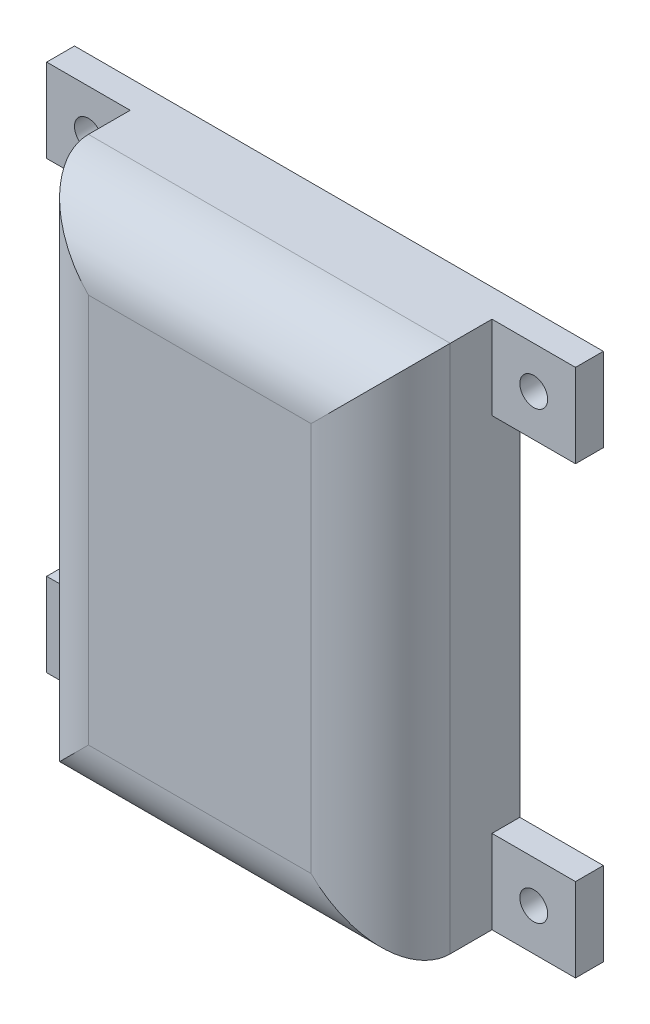
ISO-10303-21;
HEADER;
FILE_DESCRIPTION(('STEP AP214'),'2;1');
FILE_NAME('part.step','',(''),(''),'','','');
FILE_SCHEMA(('AUTOMOTIVE_DESIGN { 1 0 10303 214 1 1 1 1 }'));
ENDSEC;
DATA;
#1=APPLICATION_CONTEXT('core data for automotive mechanical design processes');
#2=APPLICATION_PROTOCOL_DEFINITION('international standard','automotive_design',2000,#1);
#3=PRODUCT_CONTEXT('',#1,'mechanical');
#4=PRODUCT('Part','Part','',(#3));
#5=PRODUCT_RELATED_PRODUCT_CATEGORY('part','',(#4));
#6=PRODUCT_DEFINITION_FORMATION('','',#4);
#7=PRODUCT_DEFINITION_CONTEXT('part definition',#1,'design');
#8=PRODUCT_DEFINITION('design','',#6,#7);
#9=PRODUCT_DEFINITION_SHAPE('','',#8);
#10=(LENGTH_UNIT() NAMED_UNIT(*) SI_UNIT(.MILLI.,.METRE.));
#11=(NAMED_UNIT(*) PLANE_ANGLE_UNIT() SI_UNIT($,.RADIAN.));
#12=(NAMED_UNIT(*) SI_UNIT($,.STERADIAN.) SOLID_ANGLE_UNIT());
#13=UNCERTAINTY_MEASURE_WITH_UNIT(LENGTH_MEASURE(1.E-05),#10,'distance_accuracy_value','');
#14=(GEOMETRIC_REPRESENTATION_CONTEXT(3) GLOBAL_UNCERTAINTY_ASSIGNED_CONTEXT((#13)) GLOBAL_UNIT_ASSIGNED_CONTEXT((#10,
#11,#12)) REPRESENTATION_CONTEXT('',''));
#15=CARTESIAN_POINT('',(0.,0.,0.));
#16=DIRECTION('',(0.,0.,1.));
#17=DIRECTION('',(1.,0.,0.));
#18=AXIS2_PLACEMENT_3D('',#15,#16,#17);
#19=CARTESIAN_POINT('',(-13.,19.,0.));
#20=DIRECTION('',(0.,0.,1.));
#21=DIRECTION('',(1.,0.,0.));
#22=AXIS2_PLACEMENT_3D('',#19,#20,#21);
#23=PLANE('',#22);
#24=CARTESIAN_POINT('',(16.,-16.,0.));
#25=DIRECTION('',(0.,0.,1.));
#26=DIRECTION('',(1.,0.,0.));
#27=AXIS2_PLACEMENT_3D('',#24,#25,#26);
#28=CIRCLE('',#27,1.00000000000001);
#29=CARTESIAN_POINT('',(17.,-16.,0.));
#30=VERTEX_POINT('',#29);
#31=EDGE_CURVE('E752',#30,#30,#28,.T.);
#32=ORIENTED_EDGE('',*,*,#31,.T.);
#33=EDGE_LOOP('',(#32));
#34=FACE_BOUND('',#33,.T.);
#35=CARTESIAN_POINT('',(-16.,16.,0.));
#36=DIRECTION('',(0.,0.,1.));
#37=DIRECTION('',(1.,0.,0.));
#38=AXIS2_PLACEMENT_3D('',#35,#36,#37);
#39=CIRCLE('',#38,1.);
#40=CARTESIAN_POINT('',(-15.,16.,0.));
#41=VERTEX_POINT('',#40);
#42=EDGE_CURVE('E763',#41,#41,#39,.T.);
#43=ORIENTED_EDGE('',*,*,#42,.T.);
#44=EDGE_LOOP('',(#43));
#45=FACE_BOUND('',#44,.T.);
#46=DIRECTION('',(0.,-1.,0.));
#47=VECTOR('',#46,1.);
#48=CARTESIAN_POINT('',(-13.,-19.,0.));
#49=LINE('',#48,#47);
#50=CARTESIAN_POINT('',(-13.,13.,0.));
#51=VERTEX_POINT('',#50);
#52=CARTESIAN_POINT('',(-13.,-13.,0.));
#53=VERTEX_POINT('',#52);
#54=EDGE_CURVE('E246',#51,#53,#49,.T.);
#55=ORIENTED_EDGE('',*,*,#54,.F.);
#56=DIRECTION('',(1.,0.,0.));
#57=VECTOR('',#56,1.);
#58=CARTESIAN_POINT('',(-13.,13.,0.));
#59=LINE('',#58,#57);
#60=CARTESIAN_POINT('',(-19.,13.,0.));
#61=VERTEX_POINT('',#60);
#62=EDGE_CURVE('E213',#61,#51,#59,.T.);
#63=ORIENTED_EDGE('',*,*,#62,.F.);
#64=DIRECTION('',(0.,-1.,0.));
#65=VECTOR('',#64,1.);
#66=CARTESIAN_POINT('',(-19.,19.,0.));
#67=LINE('',#66,#65);
#68=CARTESIAN_POINT('',(-19.,19.,0.));
#69=VERTEX_POINT('',#68);
#70=EDGE_CURVE('E211',#69,#61,#67,.T.);
#71=ORIENTED_EDGE('',*,*,#70,.F.);
#72=DIRECTION('',(-1.,0.,0.));
#73=VECTOR('',#72,1.);
#74=CARTESIAN_POINT('',(13.,19.,0.));
#75=LINE('',#74,#73);
#76=CARTESIAN_POINT('',(19.,19.,0.));
#77=VERTEX_POINT('',#76);
#78=EDGE_CURVE('E196',#77,#69,#75,.T.);
#79=ORIENTED_EDGE('',*,*,#78,.F.);
#80=DIRECTION('',(0.,1.,0.));
#81=VECTOR('',#80,1.);
#82=CARTESIAN_POINT('',(19.,19.,0.));
#83=LINE('',#82,#81);
#84=CARTESIAN_POINT('',(19.,13.,0.));
#85=VERTEX_POINT('',#84);
#86=EDGE_CURVE('E305',#85,#77,#83,.T.);
#87=ORIENTED_EDGE('',*,*,#86,.F.);
#88=DIRECTION('',(1.,0.,0.));
#89=VECTOR('',#88,1.);
#90=CARTESIAN_POINT('',(13.,13.,0.));
#91=LINE('',#90,#89);
#92=CARTESIAN_POINT('',(13.,13.,0.));
#93=VERTEX_POINT('',#92);
#94=EDGE_CURVE('E302',#93,#85,#91,.T.);
#95=ORIENTED_EDGE('',*,*,#94,.F.);
#96=DIRECTION('',(0.,1.,0.));
#97=VECTOR('',#96,1.);
#98=CARTESIAN_POINT('',(13.,-19.,0.));
#99=LINE('',#98,#97);
#100=CARTESIAN_POINT('',(13.,-13.,0.));
#101=VERTEX_POINT('',#100);
#102=EDGE_CURVE('E258',#101,#93,#99,.T.);
#103=ORIENTED_EDGE('',*,*,#102,.F.);
#104=DIRECTION('',(-1.,0.,0.));
#105=VECTOR('',#104,1.);
#106=CARTESIAN_POINT('',(13.,-13.,0.));
#107=LINE('',#106,#105);
#108=CARTESIAN_POINT('',(19.,-13.,0.));
#109=VERTEX_POINT('',#108);
#110=EDGE_CURVE('E500',#109,#101,#107,.T.);
#111=ORIENTED_EDGE('',*,*,#110,.F.);
#112=DIRECTION('',(0.,1.,0.));
#113=VECTOR('',#112,1.);
#114=CARTESIAN_POINT('',(19.,-19.,0.));
#115=LINE('',#114,#113);
#116=CARTESIAN_POINT('',(19.,-19.,0.));
#117=VERTEX_POINT('',#116);
#118=EDGE_CURVE('E243',#117,#109,#115,.T.);
#119=ORIENTED_EDGE('',*,*,#118,.F.);
#120=DIRECTION('',(1.,0.,0.));
#121=VECTOR('',#120,1.);
#122=CARTESIAN_POINT('',(13.,-19.,0.));
#123=LINE('',#122,#121);
#124=CARTESIAN_POINT('',(-19.,-19.,0.));
#125=VERTEX_POINT('',#124);
#126=EDGE_CURVE('E249',#125,#117,#123,.T.);
#127=ORIENTED_EDGE('',*,*,#126,.F.);
#128=DIRECTION('',(0.,-1.,0.));
#129=VECTOR('',#128,1.);
#130=CARTESIAN_POINT('',(-19.,-19.,0.));
#131=LINE('',#130,#129);
#132=CARTESIAN_POINT('',(-19.,-13.,0.));
#133=VERTEX_POINT('',#132);
#134=EDGE_CURVE('E225',#133,#125,#131,.T.);
#135=ORIENTED_EDGE('',*,*,#134,.F.);
#136=DIRECTION('',(-1.,0.,0.));
#137=VECTOR('',#136,1.);
#138=CARTESIAN_POINT('',(-13.,-13.,0.));
#139=LINE('',#138,#137);
#140=EDGE_CURVE('E199',#53,#133,#139,.T.);
#141=ORIENTED_EDGE('',*,*,#140,.F.);
#142=EDGE_LOOP('',(#55,#63,#71,#79,#87,#95,#103,#111,#119,#127,#135,#141));
#143=FACE_BOUND('',#142,.T.);
#144=DIRECTION('',(0.,-1.,0.));
#145=VECTOR('',#144,1.);
#146=CARTESIAN_POINT('',(-11.,-17.,0.));
#147=LINE('',#146,#145);
#148=CARTESIAN_POINT('',(-11.,17.,0.));
#149=VERTEX_POINT('',#148);
#150=CARTESIAN_POINT('',(-11.,-17.,0.));
#151=VERTEX_POINT('',#150);
#152=EDGE_CURVE('E336',#149,#151,#147,.T.);
#153=ORIENTED_EDGE('',*,*,#152,.T.);
#154=DIRECTION('',(1.,0.,0.));
#155=VECTOR('',#154,1.);
#156=CARTESIAN_POINT('',(11.,-17.,0.));
#157=LINE('',#156,#155);
#158=CARTESIAN_POINT('',(11.,-17.,0.));
#159=VERTEX_POINT('',#158);
#160=EDGE_CURVE('E339',#151,#159,#157,.T.);
#161=ORIENTED_EDGE('',*,*,#160,.T.);
#162=DIRECTION('',(0.,1.,0.));
#163=VECTOR('',#162,1.);
#164=CARTESIAN_POINT('',(11.,-17.,0.));
#165=LINE('',#164,#163);
#166=CARTESIAN_POINT('',(11.,17.,0.));
#167=VERTEX_POINT('',#166);
#168=EDGE_CURVE('E342',#159,#167,#165,.T.);
#169=ORIENTED_EDGE('',*,*,#168,.T.);
#170=DIRECTION('',(-1.,0.,0.));
#171=VECTOR('',#170,1.);
#172=CARTESIAN_POINT('',(11.,17.,0.));
#173=LINE('',#172,#171);
#174=EDGE_CURVE('E329',#167,#149,#173,.T.);
#175=ORIENTED_EDGE('',*,*,#174,.T.);
#176=EDGE_LOOP('',(#153,#161,#169,#175));
#177=FACE_BOUND('',#176,.T.);
#178=CARTESIAN_POINT('',(-16.,-16.,0.));
#179=DIRECTION('',(0.,0.,1.));
#180=DIRECTION('',(1.,0.,0.));
#181=AXIS2_PLACEMENT_3D('',#178,#179,#180);
#182=CIRCLE('',#181,1.);
#183=CARTESIAN_POINT('',(-15.,-16.,0.));
#184=VERTEX_POINT('',#183);
#185=EDGE_CURVE('E758',#184,#184,#182,.T.);
#186=ORIENTED_EDGE('',*,*,#185,.T.);
#187=EDGE_LOOP('',(#186));
#188=FACE_BOUND('',#187,.T.);
#189=CARTESIAN_POINT('',(16.,16.,0.));
#190=DIRECTION('',(0.,0.,1.));
#191=DIRECTION('',(1.,0.,0.));
#192=AXIS2_PLACEMENT_3D('',#189,#190,#191);
#193=CIRCLE('',#192,1.);
#194=CARTESIAN_POINT('',(17.,16.,0.));
#195=VERTEX_POINT('',#194);
#196=EDGE_CURVE('E428',#195,#195,#193,.T.);
#197=ORIENTED_EDGE('',*,*,#196,.T.);
#198=EDGE_LOOP('',(#197));
#199=FACE_BOUND('',#198,.T.);
#200=ADVANCED_FACE('F31',(#34,#45,#143,#177,#188,#199),#23,.F.);
#201=CARTESIAN_POINT('',(13.,13.,2.));
#202=DIRECTION('',(0.,0.,1.));
#203=DIRECTION('',(1.,0.,0.));
#204=AXIS2_PLACEMENT_3D('',#201,#202,#203);
#205=PLANE('',#204);
#206=DIRECTION('',(0.,-1.,0.));
#207=VECTOR('',#206,1.);
#208=CARTESIAN_POINT('',(13.,19.,2.));
#209=LINE('',#208,#207);
#210=CARTESIAN_POINT('',(13.,19.,2.));
#211=VERTEX_POINT('',#210);
#212=CARTESIAN_POINT('',(13.,13.,2.));
#213=VERTEX_POINT('',#212);
#214=EDGE_CURVE('E314',#211,#213,#209,.T.);
#215=ORIENTED_EDGE('',*,*,#214,.T.);
#216=DIRECTION('',(1.,0.,0.));
#217=VECTOR('',#216,1.);
#218=CARTESIAN_POINT('',(13.,13.,2.));
#219=LINE('',#218,#217);
#220=CARTESIAN_POINT('',(19.,13.,2.));
#221=VERTEX_POINT('',#220);
#222=EDGE_CURVE('E311',#213,#221,#219,.T.);
#223=ORIENTED_EDGE('',*,*,#222,.T.);
#224=DIRECTION('',(0.,1.,0.));
#225=VECTOR('',#224,1.);
#226=CARTESIAN_POINT('',(19.,19.,2.));
#227=LINE('',#226,#225);
#228=CARTESIAN_POINT('',(19.,19.,2.));
#229=VERTEX_POINT('',#228);
#230=EDGE_CURVE('E313',#221,#229,#227,.T.);
#231=ORIENTED_EDGE('',*,*,#230,.T.);
#232=DIRECTION('',(-1.,0.,0.));
#233=VECTOR('',#232,1.);
#234=CARTESIAN_POINT('',(13.,19.,2.));
#235=LINE('',#234,#233);
#236=EDGE_CURVE('E316',#229,#211,#235,.T.);
#237=ORIENTED_EDGE('',*,*,#236,.T.);
#238=EDGE_LOOP('',(#215,#223,#231,#237));
#239=FACE_BOUND('',#238,.T.);
#240=CARTESIAN_POINT('',(16.,16.,2.));
#241=DIRECTION('',(0.,0.,1.));
#242=DIRECTION('',(1.,0.,0.));
#243=AXIS2_PLACEMENT_3D('',#240,#241,#242);
#244=CIRCLE('',#243,1.);
#245=CARTESIAN_POINT('',(17.,16.,2.));
#246=VERTEX_POINT('',#245);
#247=EDGE_CURVE('E431',#246,#246,#244,.T.);
#248=ORIENTED_EDGE('',*,*,#247,.F.);
#249=EDGE_LOOP('',(#248));
#250=FACE_BOUND('',#249,.T.);
#251=ADVANCED_FACE('F381',(#239,#250),#205,.T.);
#252=CARTESIAN_POINT('',(13.,-13.,2.));
#253=DIRECTION('',(0.,0.,-1.));
#254=DIRECTION('',(-1.,0.,0.));
#255=AXIS2_PLACEMENT_3D('',#252,#253,#254);
#256=PLANE('',#255);
#257=DIRECTION('',(0.,-1.,0.));
#258=VECTOR('',#257,1.);
#259=CARTESIAN_POINT('',(13.,-19.,2.));
#260=LINE('',#259,#258);
#261=CARTESIAN_POINT('',(13.,-13.,2.));
#262=VERTEX_POINT('',#261);
#263=CARTESIAN_POINT('',(13.,-19.,2.));
#264=VERTEX_POINT('',#263);
#265=EDGE_CURVE('E237',#262,#264,#260,.T.);
#266=ORIENTED_EDGE('',*,*,#265,.T.);
#267=DIRECTION('',(1.,0.,0.));
#268=VECTOR('',#267,1.);
#269=CARTESIAN_POINT('',(13.,-19.,2.));
#270=LINE('',#269,#268);
#271=CARTESIAN_POINT('',(19.,-19.,2.));
#272=VERTEX_POINT('',#271);
#273=EDGE_CURVE('E492',#264,#272,#270,.T.);
#274=ORIENTED_EDGE('',*,*,#273,.T.);
#275=DIRECTION('',(0.,1.,0.));
#276=VECTOR('',#275,1.);
#277=CARTESIAN_POINT('',(19.,-19.,2.));
#278=LINE('',#277,#276);
#279=CARTESIAN_POINT('',(19.,-13.,2.));
#280=VERTEX_POINT('',#279);
#281=EDGE_CURVE('E301',#272,#280,#278,.T.);
#282=ORIENTED_EDGE('',*,*,#281,.T.);
#283=DIRECTION('',(-1.,0.,0.));
#284=VECTOR('',#283,1.);
#285=CARTESIAN_POINT('',(13.,-13.,2.));
#286=LINE('',#285,#284);
#287=EDGE_CURVE('E498',#280,#262,#286,.T.);
#288=ORIENTED_EDGE('',*,*,#287,.T.);
#289=EDGE_LOOP('',(#266,#274,#282,#288));
#290=FACE_BOUND('',#289,.T.);
#291=CARTESIAN_POINT('',(16.,-16.,2.));
#292=DIRECTION('',(0.,0.,1.));
#293=DIRECTION('',(1.,0.,0.));
#294=AXIS2_PLACEMENT_3D('',#291,#292,#293);
#295=CIRCLE('',#294,1.00000000000001);
#296=CARTESIAN_POINT('',(17.,-16.,2.));
#297=VERTEX_POINT('',#296);
#298=EDGE_CURVE('E754',#297,#297,#295,.T.);
#299=ORIENTED_EDGE('',*,*,#298,.F.);
#300=EDGE_LOOP('',(#299));
#301=FACE_BOUND('',#300,.T.);
#302=ADVANCED_FACE('F387',(#290,#301),#256,.F.);
#303=CARTESIAN_POINT('',(-13.,-13.,2.));
#304=DIRECTION('',(0.,0.,1.));
#305=DIRECTION('',(1.,0.,0.));
#306=AXIS2_PLACEMENT_3D('',#303,#304,#305);
#307=PLANE('',#306);
#308=DIRECTION('',(0.,1.,0.));
#309=VECTOR('',#308,1.);
#310=CARTESIAN_POINT('',(-13.,-19.,2.));
#311=LINE('',#310,#309);
#312=CARTESIAN_POINT('',(-13.,-19.,2.));
#313=VERTEX_POINT('',#312);
#314=CARTESIAN_POINT('',(-13.,-13.,2.));
#315=VERTEX_POINT('',#314);
#316=EDGE_CURVE('E222',#313,#315,#311,.T.);
#317=ORIENTED_EDGE('',*,*,#316,.T.);
#318=DIRECTION('',(-1.,0.,0.));
#319=VECTOR('',#318,1.);
#320=CARTESIAN_POINT('',(-13.,-13.,2.));
#321=LINE('',#320,#319);
#322=CARTESIAN_POINT('',(-19.,-13.,2.));
#323=VERTEX_POINT('',#322);
#324=EDGE_CURVE('E219',#315,#323,#321,.T.);
#325=ORIENTED_EDGE('',*,*,#324,.T.);
#326=DIRECTION('',(0.,-1.,0.));
#327=VECTOR('',#326,1.);
#328=CARTESIAN_POINT('',(-19.,-19.,2.));
#329=LINE('',#328,#327);
#330=CARTESIAN_POINT('',(-19.,-19.,2.));
#331=VERTEX_POINT('',#330);
#332=EDGE_CURVE('E221',#323,#331,#329,.T.);
#333=ORIENTED_EDGE('',*,*,#332,.T.);
#334=DIRECTION('',(1.,0.,0.));
#335=VECTOR('',#334,1.);
#336=CARTESIAN_POINT('',(-13.,-19.,2.));
#337=LINE('',#336,#335);
#338=EDGE_CURVE('E224',#331,#313,#337,.T.);
#339=ORIENTED_EDGE('',*,*,#338,.T.);
#340=EDGE_LOOP('',(#317,#325,#333,#339));
#341=FACE_BOUND('',#340,.T.);
#342=CARTESIAN_POINT('',(-16.,-16.,2.));
#343=DIRECTION('',(0.,0.,1.));
#344=DIRECTION('',(1.,0.,0.));
#345=AXIS2_PLACEMENT_3D('',#342,#343,#344);
#346=CIRCLE('',#345,1.);
#347=CARTESIAN_POINT('',(-15.,-16.,2.));
#348=VERTEX_POINT('',#347);
#349=EDGE_CURVE('E760',#348,#348,#346,.T.);
#350=ORIENTED_EDGE('',*,*,#349,.F.);
#351=EDGE_LOOP('',(#350));
#352=FACE_BOUND('',#351,.T.);
#353=ADVANCED_FACE('F600',(#341,#352),#307,.T.);
#354=CARTESIAN_POINT('',(-13.,13.,2.));
#355=DIRECTION('',(0.,0.,-1.));
#356=DIRECTION('',(-1.,0.,0.));
#357=AXIS2_PLACEMENT_3D('',#354,#355,#356);
#358=PLANE('',#357);
#359=DIRECTION('',(0.,1.,0.));
#360=VECTOR('',#359,1.);
#361=CARTESIAN_POINT('',(-13.,19.,2.));
#362=LINE('',#361,#360);
#363=CARTESIAN_POINT('',(-13.,13.,2.));
#364=VERTEX_POINT('',#363);
#365=CARTESIAN_POINT('',(-13.,19.,2.));
#366=VERTEX_POINT('',#365);
#367=EDGE_CURVE('E189',#364,#366,#362,.T.);
#368=ORIENTED_EDGE('',*,*,#367,.T.);
#369=DIRECTION('',(-1.,0.,0.));
#370=VECTOR('',#369,1.);
#371=CARTESIAN_POINT('',(-13.,19.,2.));
#372=LINE('',#371,#370);
#373=CARTESIAN_POINT('',(-19.,19.,2.));
#374=VERTEX_POINT('',#373);
#375=EDGE_CURVE('E181',#366,#374,#372,.T.);
#376=ORIENTED_EDGE('',*,*,#375,.T.);
#377=DIRECTION('',(0.,-1.,0.));
#378=VECTOR('',#377,1.);
#379=CARTESIAN_POINT('',(-19.,19.,2.));
#380=LINE('',#379,#378);
#381=CARTESIAN_POINT('',(-19.,13.,2.));
#382=VERTEX_POINT('',#381);
#383=EDGE_CURVE('E187',#374,#382,#380,.T.);
#384=ORIENTED_EDGE('',*,*,#383,.T.);
#385=DIRECTION('',(1.,0.,0.));
#386=VECTOR('',#385,1.);
#387=CARTESIAN_POINT('',(-13.,13.,2.));
#388=LINE('',#387,#386);
#389=EDGE_CURVE('E205',#382,#364,#388,.T.);
#390=ORIENTED_EDGE('',*,*,#389,.T.);
#391=EDGE_LOOP('',(#368,#376,#384,#390));
#392=FACE_BOUND('',#391,.T.);
#393=CARTESIAN_POINT('',(-16.,16.,2.));
#394=DIRECTION('',(0.,0.,1.));
#395=DIRECTION('',(1.,0.,0.));
#396=AXIS2_PLACEMENT_3D('',#393,#394,#395);
#397=CIRCLE('',#396,1.);
#398=CARTESIAN_POINT('',(-15.,16.,2.));
#399=VERTEX_POINT('',#398);
#400=EDGE_CURVE('E214',#399,#399,#397,.T.);
#401=ORIENTED_EDGE('',*,*,#400,.F.);
#402=EDGE_LOOP('',(#401));
#403=FACE_BOUND('',#402,.T.);
#404=ADVANCED_FACE('F183',(#392,#403),#358,.F.);
#405=CARTESIAN_POINT('',(-13.,-19.,10.));
#406=DIRECTION('',(1.,0.,0.));
#407=DIRECTION('',(0.,0.,-1.));
#408=AXIS2_PLACEMENT_3D('',#405,#406,#407);
#409=PLANE('',#408);
#410=DIRECTION('',(0.,0.,-1.));
#411=VECTOR('',#410,1.);
#412=CARTESIAN_POINT('',(-13.,-19.,10.));
#413=LINE('',#412,#411);
#414=CARTESIAN_POINT('',(-13.,-19.,5.));
#415=VERTEX_POINT('',#414);
#416=EDGE_CURVE('E445',#415,#313,#413,.T.);
#417=ORIENTED_EDGE('',*,*,#416,.F.);
#418=DIRECTION('',(0.,-1.,0.));
#419=VECTOR('',#418,1.);
#420=CARTESIAN_POINT('',(-13.,19.,5.));
#421=LINE('',#420,#419);
#422=CARTESIAN_POINT('',(-13.,19.,5.));
#423=VERTEX_POINT('',#422);
#424=EDGE_CURVE('E48',#415,#423,#421,.F.);
#425=ORIENTED_EDGE('',*,*,#424,.T.);
#426=DIRECTION('',(0.,0.,-1.));
#427=VECTOR('',#426,1.);
#428=CARTESIAN_POINT('',(-13.,19.,10.));
#429=LINE('',#428,#427);
#430=EDGE_CURVE('E470',#423,#366,#429,.T.);
#431=ORIENTED_EDGE('',*,*,#430,.T.);
#432=ORIENTED_EDGE('',*,*,#367,.F.);
#433=DIRECTION('',(0.,0.,-1.));
#434=VECTOR('',#433,1.);
#435=CARTESIAN_POINT('',(-13.,13.,2.));
#436=LINE('',#435,#434);
#437=EDGE_CURVE('E207',#364,#51,#436,.T.);
#438=ORIENTED_EDGE('',*,*,#437,.T.);
#439=ORIENTED_EDGE('',*,*,#54,.T.);
#440=DIRECTION('',(0.,0.,-1.));
#441=VECTOR('',#440,1.);
#442=CARTESIAN_POINT('',(-13.,-13.,2.));
#443=LINE('',#442,#441);
#444=EDGE_CURVE('E234',#315,#53,#443,.T.);
#445=ORIENTED_EDGE('',*,*,#444,.F.);
#446=ORIENTED_EDGE('',*,*,#316,.F.);
#447=EDGE_LOOP('',(#417,#425,#431,#432,#438,#439,#445,#446));
#448=FACE_BOUND('',#447,.T.);
#449=ADVANCED_FACE('F401',(#448),#409,.F.);
#450=CARTESIAN_POINT('',(13.,-19.,10.));
#451=DIRECTION('',(-1.,0.,0.));
#452=DIRECTION('',(0.,0.,1.));
#453=AXIS2_PLACEMENT_3D('',#450,#451,#452);
#454=PLANE('',#453);
#455=DIRECTION('',(0.,0.,-1.));
#456=VECTOR('',#455,1.);
#457=CARTESIAN_POINT('',(13.,19.,10.));
#458=LINE('',#457,#456);
#459=CARTESIAN_POINT('',(13.,19.,5.));
#460=VERTEX_POINT('',#459);
#461=EDGE_CURVE('E468',#460,#211,#458,.T.);
#462=ORIENTED_EDGE('',*,*,#461,.F.);
#463=DIRECTION('',(0.,1.,0.));
#464=VECTOR('',#463,1.);
#465=CARTESIAN_POINT('',(13.,-19.,5.));
#466=LINE('',#465,#464);
#467=CARTESIAN_POINT('',(13.,-19.,5.));
#468=VERTEX_POINT('',#467);
#469=EDGE_CURVE('E444',#460,#468,#466,.F.);
#470=ORIENTED_EDGE('',*,*,#469,.T.);
#471=DIRECTION('',(0.,0.,-1.));
#472=VECTOR('',#471,1.);
#473=CARTESIAN_POINT('',(13.,-19.,10.));
#474=LINE('',#473,#472);
#475=EDGE_CURVE('E448',#468,#264,#474,.T.);
#476=ORIENTED_EDGE('',*,*,#475,.T.);
#477=ORIENTED_EDGE('',*,*,#265,.F.);
#478=DIRECTION('',(0.,0.,-1.));
#479=VECTOR('',#478,1.);
#480=CARTESIAN_POINT('',(13.,-13.,2.));
#481=LINE('',#480,#479);
#482=EDGE_CURVE('E307',#262,#101,#481,.T.);
#483=ORIENTED_EDGE('',*,*,#482,.T.);
#484=ORIENTED_EDGE('',*,*,#102,.T.);
#485=DIRECTION('',(0.,0.,-1.));
#486=VECTOR('',#485,1.);
#487=CARTESIAN_POINT('',(13.,13.,2.));
#488=LINE('',#487,#486);
#489=EDGE_CURVE('E265',#213,#93,#488,.T.);
#490=ORIENTED_EDGE('',*,*,#489,.F.);
#491=ORIENTED_EDGE('',*,*,#214,.F.);
#492=EDGE_LOOP('',(#462,#470,#476,#477,#483,#484,#490,#491));
#493=FACE_BOUND('',#492,.T.);
#494=ADVANCED_FACE('F398',(#493),#454,.F.);
#495=CARTESIAN_POINT('',(13.,-19.,10.));
#496=DIRECTION('',(0.,1.,0.));
#497=DIRECTION('',(-1.,0.,0.));
#498=AXIS2_PLACEMENT_3D('',#495,#496,#497);
#499=PLANE('',#498);
#500=ORIENTED_EDGE('',*,*,#475,.F.);
#501=DIRECTION('',(1.,0.,0.));
#502=VECTOR('',#501,1.);
#503=CARTESIAN_POINT('',(-13.,-19.,5.));
#504=LINE('',#503,#502);
#505=EDGE_CURVE('E11',#468,#415,#504,.F.);
#506=ORIENTED_EDGE('',*,*,#505,.T.);
#507=ORIENTED_EDGE('',*,*,#416,.T.);
#508=ORIENTED_EDGE('',*,*,#338,.F.);
#509=DIRECTION('',(0.,0.,-1.));
#510=VECTOR('',#509,1.);
#511=CARTESIAN_POINT('',(-19.,-19.,2.));
#512=LINE('',#511,#510);
#513=EDGE_CURVE('E228',#331,#125,#512,.T.);
#514=ORIENTED_EDGE('',*,*,#513,.T.);
#515=ORIENTED_EDGE('',*,*,#126,.T.);
#516=DIRECTION('',(0.,0.,-1.));
#517=VECTOR('',#516,1.);
#518=CARTESIAN_POINT('',(19.,-19.,2.));
#519=LINE('',#518,#517);
#520=EDGE_CURVE('E294',#272,#117,#519,.T.);
#521=ORIENTED_EDGE('',*,*,#520,.F.);
#522=ORIENTED_EDGE('',*,*,#273,.F.);
#523=EDGE_LOOP('',(#500,#506,#507,#508,#514,#515,#521,#522));
#524=FACE_BOUND('',#523,.T.);
#525=ADVANCED_FACE('F292',(#524),#499,.F.);
#526=CARTESIAN_POINT('',(13.,19.,10.));
#527=DIRECTION('',(0.,-1.,0.));
#528=DIRECTION('',(0.,0.,-1.));
#529=AXIS2_PLACEMENT_3D('',#526,#527,#528);
#530=PLANE('',#529);
#531=ORIENTED_EDGE('',*,*,#430,.F.);
#532=DIRECTION('',(-1.,0.,0.));
#533=VECTOR('',#532,1.);
#534=CARTESIAN_POINT('',(13.,19.,5.));
#535=LINE('',#534,#533);
#536=EDGE_CURVE('E40',#423,#460,#535,.F.);
#537=ORIENTED_EDGE('',*,*,#536,.T.);
#538=ORIENTED_EDGE('',*,*,#461,.T.);
#539=ORIENTED_EDGE('',*,*,#236,.F.);
#540=DIRECTION('',(0.,0.,-1.));
#541=VECTOR('',#540,1.);
#542=CARTESIAN_POINT('',(19.,19.,2.));
#543=LINE('',#542,#541);
#544=EDGE_CURVE('E319',#229,#77,#543,.T.);
#545=ORIENTED_EDGE('',*,*,#544,.T.);
#546=ORIENTED_EDGE('',*,*,#78,.T.);
#547=DIRECTION('',(0.,0.,-1.));
#548=VECTOR('',#547,1.);
#549=CARTESIAN_POINT('',(-19.,19.,2.));
#550=LINE('',#549,#548);
#551=EDGE_CURVE('E193',#374,#69,#550,.T.);
#552=ORIENTED_EDGE('',*,*,#551,.F.);
#553=ORIENTED_EDGE('',*,*,#375,.F.);
#554=EDGE_LOOP('',(#531,#537,#538,#539,#545,#546,#552,#553));
#555=FACE_BOUND('',#554,.T.);
#556=ADVANCED_FACE('F194',(#555),#530,.F.);
#557=CARTESIAN_POINT('',(-13.,19.,10.));
#558=DIRECTION('',(0.,0.,1.));
#559=DIRECTION('',(1.,0.,0.));
#560=AXIS2_PLACEMENT_3D('',#557,#558,#559);
#561=PLANE('',#560);
#562=DIRECTION('',(0.,1.,0.));
#563=VECTOR('',#562,1.);
#564=CARTESIAN_POINT('',(8.,19.,10.));
#565=LINE('',#564,#563);
#566=CARTESIAN_POINT('',(8.,-14.,10.));
#567=VERTEX_POINT('',#566);
#568=CARTESIAN_POINT('',(8.,14.,10.));
#569=VERTEX_POINT('',#568);
#570=EDGE_CURVE('E486',#567,#569,#565,.T.);
#571=ORIENTED_EDGE('',*,*,#570,.T.);
#572=DIRECTION('',(-1.,0.,0.));
#573=VECTOR('',#572,1.);
#574=CARTESIAN_POINT('',(-13.,14.,10.));
#575=LINE('',#574,#573);
#576=CARTESIAN_POINT('',(-8.,14.,10.));
#577=VERTEX_POINT('',#576);
#578=EDGE_CURVE('E484',#569,#577,#575,.T.);
#579=ORIENTED_EDGE('',*,*,#578,.T.);
#580=DIRECTION('',(0.,-1.,0.));
#581=VECTOR('',#580,1.);
#582=CARTESIAN_POINT('',(-8.,-19.,10.));
#583=LINE('',#582,#581);
#584=CARTESIAN_POINT('',(-8.,-14.,10.));
#585=VERTEX_POINT('',#584);
#586=EDGE_CURVE('E488',#577,#585,#583,.T.);
#587=ORIENTED_EDGE('',*,*,#586,.T.);
#588=DIRECTION('',(1.,0.,0.));
#589=VECTOR('',#588,1.);
#590=CARTESIAN_POINT('',(13.,-14.,10.));
#591=LINE('',#590,#589);
#592=EDGE_CURVE('E251',#585,#567,#591,.T.);
#593=ORIENTED_EDGE('',*,*,#592,.T.);
#594=EDGE_LOOP('',(#571,#579,#587,#593));
#595=FACE_BOUND('',#594,.T.);
#596=ADVANCED_FACE('F394',(#595),#561,.T.);
#597=CARTESIAN_POINT('',(-11.,-17.,8.));
#598=DIRECTION('',(1.,0.,0.));
#599=DIRECTION('',(0.,0.,-1.));
#600=AXIS2_PLACEMENT_3D('',#597,#598,#599);
#601=PLANE('',#600);
#602=ORIENTED_EDGE('',*,*,#152,.F.);
#603=DIRECTION('',(0.,0.,-1.));
#604=VECTOR('',#603,1.);
#605=CARTESIAN_POINT('',(-11.,17.,8.));
#606=LINE('',#605,#604);
#607=CARTESIAN_POINT('',(-11.,17.,8.));
#608=VERTEX_POINT('',#607);
#609=EDGE_CURVE('E335',#608,#149,#606,.T.);
#610=ORIENTED_EDGE('',*,*,#609,.F.);
#611=DIRECTION('',(0.,-1.,0.));
#612=VECTOR('',#611,1.);
#613=CARTESIAN_POINT('',(-11.,-17.,8.));
#614=LINE('',#613,#612);
#615=CARTESIAN_POINT('',(-11.,-17.,8.));
#616=VERTEX_POINT('',#615);
#617=EDGE_CURVE('E325',#608,#616,#614,.T.);
#618=ORIENTED_EDGE('',*,*,#617,.T.);
#619=DIRECTION('',(0.,0.,-1.));
#620=VECTOR('',#619,1.);
#621=CARTESIAN_POINT('',(-11.,-17.,8.));
#622=LINE('',#621,#620);
#623=EDGE_CURVE('E250',#616,#151,#622,.T.);
#624=ORIENTED_EDGE('',*,*,#623,.T.);
#625=EDGE_LOOP('',(#602,#610,#618,#624));
#626=FACE_BOUND('',#625,.T.);
#627=ADVANCED_FACE('F357',(#626),#601,.T.);
#628=CARTESIAN_POINT('',(11.,-17.,8.));
#629=DIRECTION('',(0.,1.,0.));
#630=DIRECTION('',(-1.,0.,0.));
#631=AXIS2_PLACEMENT_3D('',#628,#629,#630);
#632=PLANE('',#631);
#633=ORIENTED_EDGE('',*,*,#160,.F.);
#634=ORIENTED_EDGE('',*,*,#623,.F.);
#635=DIRECTION('',(1.,0.,0.));
#636=VECTOR('',#635,1.);
#637=CARTESIAN_POINT('',(11.,-17.,8.));
#638=LINE('',#637,#636);
#639=CARTESIAN_POINT('',(11.,-17.,8.));
#640=VERTEX_POINT('',#639);
#641=EDGE_CURVE('E328',#616,#640,#638,.T.);
#642=ORIENTED_EDGE('',*,*,#641,.T.);
#643=DIRECTION('',(0.,0.,-1.));
#644=VECTOR('',#643,1.);
#645=CARTESIAN_POINT('',(11.,-17.,8.));
#646=LINE('',#645,#644);
#647=EDGE_CURVE('E350',#640,#159,#646,.T.);
#648=ORIENTED_EDGE('',*,*,#647,.T.);
#649=EDGE_LOOP('',(#633,#634,#642,#648));
#650=FACE_BOUND('',#649,.T.);
#651=ADVANCED_FACE('F369',(#650),#632,.T.);
#652=CARTESIAN_POINT('',(11.,-17.,8.));
#653=DIRECTION('',(-1.,0.,0.));
#654=DIRECTION('',(0.,0.,1.));
#655=AXIS2_PLACEMENT_3D('',#652,#653,#654);
#656=PLANE('',#655);
#657=ORIENTED_EDGE('',*,*,#168,.F.);
#658=ORIENTED_EDGE('',*,*,#647,.F.);
#659=DIRECTION('',(0.,1.,0.));
#660=VECTOR('',#659,1.);
#661=CARTESIAN_POINT('',(11.,-17.,8.));
#662=LINE('',#661,#660);
#663=CARTESIAN_POINT('',(11.,17.,8.));
#664=VERTEX_POINT('',#663);
#665=EDGE_CURVE('E331',#640,#664,#662,.T.);
#666=ORIENTED_EDGE('',*,*,#665,.T.);
#667=DIRECTION('',(0.,0.,-1.));
#668=VECTOR('',#667,1.);
#669=CARTESIAN_POINT('',(11.,17.,8.));
#670=LINE('',#669,#668);
#671=EDGE_CURVE('E349',#664,#167,#670,.T.);
#672=ORIENTED_EDGE('',*,*,#671,.T.);
#673=EDGE_LOOP('',(#657,#658,#666,#672));
#674=FACE_BOUND('',#673,.T.);
#675=ADVANCED_FACE('F371',(#674),#656,.T.);
#676=CARTESIAN_POINT('',(11.,17.,8.));
#677=DIRECTION('',(0.,-1.,0.));
#678=DIRECTION('',(0.,0.,-1.));
#679=AXIS2_PLACEMENT_3D('',#676,#677,#678);
#680=PLANE('',#679);
#681=ORIENTED_EDGE('',*,*,#174,.F.);
#682=ORIENTED_EDGE('',*,*,#671,.F.);
#683=DIRECTION('',(-1.,0.,0.));
#684=VECTOR('',#683,1.);
#685=CARTESIAN_POINT('',(11.,17.,8.));
#686=LINE('',#685,#684);
#687=EDGE_CURVE('E333',#664,#608,#686,.T.);
#688=ORIENTED_EDGE('',*,*,#687,.T.);
#689=ORIENTED_EDGE('',*,*,#609,.T.);
#690=EDGE_LOOP('',(#681,#682,#688,#689));
#691=FACE_BOUND('',#690,.T.);
#692=ADVANCED_FACE('F364',(#691),#680,.T.);
#693=CARTESIAN_POINT('',(-11.,17.,8.));
#694=DIRECTION('',(0.,0.,1.));
#695=DIRECTION('',(1.,0.,0.));
#696=AXIS2_PLACEMENT_3D('',#693,#694,#695);
#697=PLANE('',#696);
#698=ORIENTED_EDGE('',*,*,#617,.F.);
#699=ORIENTED_EDGE('',*,*,#687,.F.);
#700=ORIENTED_EDGE('',*,*,#665,.F.);
#701=ORIENTED_EDGE('',*,*,#641,.F.);
#702=EDGE_LOOP('',(#698,#699,#700,#701));
#703=FACE_BOUND('',#702,.T.);
#704=ADVANCED_FACE('F367',(#703),#697,.F.);
#705=CARTESIAN_POINT('',(13.,13.,2.));
#706=DIRECTION('',(0.,1.,0.));
#707=DIRECTION('',(-1.,0.,0.));
#708=AXIS2_PLACEMENT_3D('',#705,#706,#707);
#709=PLANE('',#708);
#710=ORIENTED_EDGE('',*,*,#94,.T.);
#711=DIRECTION('',(0.,0.,-1.));
#712=VECTOR('',#711,1.);
#713=CARTESIAN_POINT('',(19.,13.,2.));
#714=LINE('',#713,#712);
#715=EDGE_CURVE('E321',#221,#85,#714,.T.);
#716=ORIENTED_EDGE('',*,*,#715,.F.);
#717=ORIENTED_EDGE('',*,*,#222,.F.);
#718=ORIENTED_EDGE('',*,*,#489,.T.);
#719=EDGE_LOOP('',(#710,#716,#717,#718));
#720=FACE_BOUND('',#719,.T.);
#721=ADVANCED_FACE('F477',(#720),#709,.F.);
#722=CARTESIAN_POINT('',(19.,19.,2.));
#723=DIRECTION('',(-1.,0.,0.));
#724=DIRECTION('',(0.,-1.,0.));
#725=AXIS2_PLACEMENT_3D('',#722,#723,#724);
#726=PLANE('',#725);
#727=ORIENTED_EDGE('',*,*,#86,.T.);
#728=ORIENTED_EDGE('',*,*,#544,.F.);
#729=ORIENTED_EDGE('',*,*,#230,.F.);
#730=ORIENTED_EDGE('',*,*,#715,.T.);
#731=EDGE_LOOP('',(#727,#728,#729,#730));
#732=FACE_BOUND('',#731,.T.);
#733=ADVANCED_FACE('F480',(#732),#726,.F.);
#734=CARTESIAN_POINT('',(19.,-19.,2.));
#735=DIRECTION('',(-1.,0.,0.));
#736=DIRECTION('',(0.,0.,1.));
#737=AXIS2_PLACEMENT_3D('',#734,#735,#736);
#738=PLANE('',#737);
#739=ORIENTED_EDGE('',*,*,#118,.T.);
#740=DIRECTION('',(0.,0.,-1.));
#741=VECTOR('',#740,1.);
#742=CARTESIAN_POINT('',(19.,-13.,2.));
#743=LINE('',#742,#741);
#744=EDGE_CURVE('E303',#280,#109,#743,.T.);
#745=ORIENTED_EDGE('',*,*,#744,.F.);
#746=ORIENTED_EDGE('',*,*,#281,.F.);
#747=ORIENTED_EDGE('',*,*,#520,.T.);
#748=EDGE_LOOP('',(#739,#745,#746,#747));
#749=FACE_BOUND('',#748,.T.);
#750=ADVANCED_FACE('F298',(#749),#738,.F.);
#751=CARTESIAN_POINT('',(13.,-13.,2.));
#752=DIRECTION('',(0.,-1.,0.));
#753=DIRECTION('',(0.,0.,-1.));
#754=AXIS2_PLACEMENT_3D('',#751,#752,#753);
#755=PLANE('',#754);
#756=ORIENTED_EDGE('',*,*,#110,.T.);
#757=ORIENTED_EDGE('',*,*,#482,.F.);
#758=ORIENTED_EDGE('',*,*,#287,.F.);
#759=ORIENTED_EDGE('',*,*,#744,.T.);
#760=EDGE_LOOP('',(#756,#757,#758,#759));
#761=FACE_BOUND('',#760,.T.);
#762=ADVANCED_FACE('F507',(#761),#755,.F.);
#763=CARTESIAN_POINT('',(-13.,-13.,2.));
#764=DIRECTION('',(0.,-1.,0.));
#765=DIRECTION('',(0.,0.,-1.));
#766=AXIS2_PLACEMENT_3D('',#763,#764,#765);
#767=PLANE('',#766);
#768=ORIENTED_EDGE('',*,*,#140,.T.);
#769=DIRECTION('',(0.,0.,-1.));
#770=VECTOR('',#769,1.);
#771=CARTESIAN_POINT('',(-19.,-13.,2.));
#772=LINE('',#771,#770);
#773=EDGE_CURVE('E231',#323,#133,#772,.T.);
#774=ORIENTED_EDGE('',*,*,#773,.F.);
#775=ORIENTED_EDGE('',*,*,#324,.F.);
#776=ORIENTED_EDGE('',*,*,#444,.T.);
#777=EDGE_LOOP('',(#768,#774,#775,#776));
#778=FACE_BOUND('',#777,.T.);
#779=ADVANCED_FACE('F278',(#778),#767,.F.);
#780=CARTESIAN_POINT('',(-19.,-19.,2.));
#781=DIRECTION('',(1.,0.,0.));
#782=DIRECTION('',(0.,0.,-1.));
#783=AXIS2_PLACEMENT_3D('',#780,#781,#782);
#784=PLANE('',#783);
#785=ORIENTED_EDGE('',*,*,#134,.T.);
#786=ORIENTED_EDGE('',*,*,#513,.F.);
#787=ORIENTED_EDGE('',*,*,#332,.F.);
#788=ORIENTED_EDGE('',*,*,#773,.T.);
#789=EDGE_LOOP('',(#785,#786,#787,#788));
#790=FACE_BOUND('',#789,.T.);
#791=ADVANCED_FACE('F285',(#790),#784,.F.);
#792=CARTESIAN_POINT('',(-19.,19.,2.));
#793=DIRECTION('',(1.,0.,0.));
#794=DIRECTION('',(0.,0.,-1.));
#795=AXIS2_PLACEMENT_3D('',#792,#793,#794);
#796=PLANE('',#795);
#797=ORIENTED_EDGE('',*,*,#70,.T.);
#798=DIRECTION('',(0.,0.,-1.));
#799=VECTOR('',#798,1.);
#800=CARTESIAN_POINT('',(-19.,13.,2.));
#801=LINE('',#800,#799);
#802=EDGE_CURVE('E200',#382,#61,#801,.T.);
#803=ORIENTED_EDGE('',*,*,#802,.F.);
#804=ORIENTED_EDGE('',*,*,#383,.F.);
#805=ORIENTED_EDGE('',*,*,#551,.T.);
#806=EDGE_LOOP('',(#797,#803,#804,#805));
#807=FACE_BOUND('',#806,.T.);
#808=ADVANCED_FACE('F202',(#807),#796,.F.);
#809=CARTESIAN_POINT('',(-13.,13.,2.));
#810=DIRECTION('',(0.,1.,0.));
#811=DIRECTION('',(0.,0.,1.));
#812=AXIS2_PLACEMENT_3D('',#809,#810,#811);
#813=PLANE('',#812);
#814=ORIENTED_EDGE('',*,*,#62,.T.);
#815=ORIENTED_EDGE('',*,*,#437,.F.);
#816=ORIENTED_EDGE('',*,*,#389,.F.);
#817=ORIENTED_EDGE('',*,*,#802,.T.);
#818=EDGE_LOOP('',(#814,#815,#816,#817));
#819=FACE_BOUND('',#818,.T.);
#820=ADVANCED_FACE('F566',(#819),#813,.F.);
#821=CARTESIAN_POINT('',(-16.,16.,2.));
#822=DIRECTION('',(0.,0.,-1.));
#823=DIRECTION('',(-1.,0.,0.));
#824=AXIS2_PLACEMENT_3D('',#821,#822,#823);
#825=CYLINDRICAL_SURFACE('',#824,1.);
#826=ORIENTED_EDGE('',*,*,#400,.T.);
#827=EDGE_LOOP('',(#826));
#828=FACE_BOUND('',#827,.T.);
#829=ORIENTED_EDGE('',*,*,#42,.F.);
#830=EDGE_LOOP('',(#829));
#831=FACE_BOUND('',#830,.T.);
#832=ADVANCED_FACE('F574',(#828,#831),#825,.F.);
#833=CARTESIAN_POINT('',(-16.,-16.,2.));
#834=DIRECTION('',(0.,0.,-1.));
#835=DIRECTION('',(-1.,0.,0.));
#836=AXIS2_PLACEMENT_3D('',#833,#834,#835);
#837=CYLINDRICAL_SURFACE('',#836,1.);
#838=ORIENTED_EDGE('',*,*,#349,.T.);
#839=EDGE_LOOP('',(#838));
#840=FACE_BOUND('',#839,.T.);
#841=ORIENTED_EDGE('',*,*,#185,.F.);
#842=EDGE_LOOP('',(#841));
#843=FACE_BOUND('',#842,.T.);
#844=ADVANCED_FACE('F622',(#840,#843),#837,.F.);
#845=CARTESIAN_POINT('',(16.,-16.,2.));
#846=DIRECTION('',(0.,0.,-1.));
#847=DIRECTION('',(-1.,0.,0.));
#848=AXIS2_PLACEMENT_3D('',#845,#846,#847);
#849=CYLINDRICAL_SURFACE('',#848,1.00000000000001);
#850=ORIENTED_EDGE('',*,*,#298,.T.);
#851=EDGE_LOOP('',(#850));
#852=FACE_BOUND('',#851,.T.);
#853=ORIENTED_EDGE('',*,*,#31,.F.);
#854=EDGE_LOOP('',(#853));
#855=FACE_BOUND('',#854,.T.);
#856=ADVANCED_FACE('F632',(#852,#855),#849,.F.);
#857=CARTESIAN_POINT('',(16.,16.,2.));
#858=DIRECTION('',(0.,0.,-1.));
#859=DIRECTION('',(-1.,0.,0.));
#860=AXIS2_PLACEMENT_3D('',#857,#858,#859);
#861=CYLINDRICAL_SURFACE('',#860,1.);
#862=ORIENTED_EDGE('',*,*,#247,.T.);
#863=EDGE_LOOP('',(#862));
#864=FACE_BOUND('',#863,.T.);
#865=ORIENTED_EDGE('',*,*,#196,.F.);
#866=EDGE_LOOP('',(#865));
#867=FACE_BOUND('',#866,.T.);
#868=ADVANCED_FACE('F420',(#864,#867),#861,.F.);
#869=CARTESIAN_POINT('',(-8.,19.,5.));
#870=DIRECTION('',(0.,1.,0.));
#871=DIRECTION('',(0.,0.,1.));
#872=AXIS2_PLACEMENT_3D('',#869,#870,#871);
#873=CYLINDRICAL_SURFACE('',#872,5.);
#874=CARTESIAN_POINT('',(-8.,14.,5.));
#875=DIRECTION('',(0.707106781186547,0.707106781186547,0.));
#876=DIRECTION('',(0.707106781186547,-0.707106781186547,0.));
#877=AXIS2_PLACEMENT_3D('',#874,#875,#876);
#878=ELLIPSE('',#877,7.07106781186547,5.);
#879=EDGE_CURVE('E429',#423,#577,#878,.T.);
#880=ORIENTED_EDGE('',*,*,#879,.F.);
#881=ORIENTED_EDGE('',*,*,#424,.F.);
#882=CARTESIAN_POINT('',(-8.,-14.,5.));
#883=DIRECTION('',(-0.707106781186548,0.707106781186547,0.));
#884=DIRECTION('',(-0.707106781186547,-0.707106781186548,0.));
#885=AXIS2_PLACEMENT_3D('',#882,#883,#884);
#886=ELLIPSE('',#885,7.07106781186548,5.);
#887=EDGE_CURVE('E35',#585,#415,#886,.F.);
#888=ORIENTED_EDGE('',*,*,#887,.F.);
#889=ORIENTED_EDGE('',*,*,#586,.F.);
#890=EDGE_LOOP('',(#880,#881,#888,#889));
#891=FACE_BOUND('',#890,.T.);
#892=ADVANCED_FACE('F33',(#891),#873,.T.);
#893=CARTESIAN_POINT('',(-13.,-14.,5.));
#894=DIRECTION('',(-1.,0.,0.));
#895=DIRECTION('',(0.,-1.,0.));
#896=AXIS2_PLACEMENT_3D('',#893,#894,#895);
#897=CYLINDRICAL_SURFACE('',#896,5.);
#898=ORIENTED_EDGE('',*,*,#887,.T.);
#899=ORIENTED_EDGE('',*,*,#505,.F.);
#900=CARTESIAN_POINT('',(8.,-14.,5.));
#901=DIRECTION('',(-0.707106781186547,-0.707106781186548,0.));
#902=DIRECTION('',(-0.707106781186548,0.707106781186547,0.));
#903=AXIS2_PLACEMENT_3D('',#900,#901,#902);
#904=ELLIPSE('',#903,7.07106781186547,5.);
#905=EDGE_CURVE('E434',#567,#468,#904,.F.);
#906=ORIENTED_EDGE('',*,*,#905,.F.);
#907=ORIENTED_EDGE('',*,*,#592,.F.);
#908=EDGE_LOOP('',(#898,#899,#906,#907));
#909=FACE_BOUND('',#908,.T.);
#910=ADVANCED_FACE('F413',(#909),#897,.T.);
#911=CARTESIAN_POINT('',(-13.,14.,5.));
#912=DIRECTION('',(1.,0.,0.));
#913=DIRECTION('',(0.,0.,-1.));
#914=AXIS2_PLACEMENT_3D('',#911,#912,#913);
#915=CYLINDRICAL_SURFACE('',#914,5.);
#916=ORIENTED_EDGE('',*,*,#879,.T.);
#917=ORIENTED_EDGE('',*,*,#578,.F.);
#918=CARTESIAN_POINT('',(8.,14.,5.));
#919=DIRECTION('',(0.707106781186547,-0.707106781186547,0.));
#920=DIRECTION('',(0.707106781186547,0.707106781186547,0.));
#921=AXIS2_PLACEMENT_3D('',#918,#919,#920);
#922=ELLIPSE('',#921,7.07106781186547,5.);
#923=EDGE_CURVE('E438',#460,#569,#922,.T.);
#924=ORIENTED_EDGE('',*,*,#923,.F.);
#925=ORIENTED_EDGE('',*,*,#536,.F.);
#926=EDGE_LOOP('',(#916,#917,#924,#925));
#927=FACE_BOUND('',#926,.T.);
#928=ADVANCED_FACE('F410',(#927),#915,.T.);
#929=CARTESIAN_POINT('',(8.,19.,5.));
#930=DIRECTION('',(0.,-1.,0.));
#931=DIRECTION('',(0.,0.,-1.));
#932=AXIS2_PLACEMENT_3D('',#929,#930,#931);
#933=CYLINDRICAL_SURFACE('',#932,5.);
#934=ORIENTED_EDGE('',*,*,#905,.T.);
#935=ORIENTED_EDGE('',*,*,#469,.F.);
#936=ORIENTED_EDGE('',*,*,#923,.T.);
#937=ORIENTED_EDGE('',*,*,#570,.F.);
#938=EDGE_LOOP('',(#934,#935,#936,#937));
#939=FACE_BOUND('',#938,.T.);
#940=ADVANCED_FACE('F407',(#939),#933,.T.);
#941=CLOSED_SHELL('',(#200,#251,#302,#353,#404,#449,#494,#525,#556,#596,#627,#651,#675,#692,
#704,#721,#733,#750,#762,#779,#791,#808,#820,#832,#844,#856,#868,#892,#910,#928,#940));
#942=MANIFOLD_SOLID_BREP('B2',#941);
#943=ADVANCED_BREP_SHAPE_REPRESENTATION('',(#18,#942),#14);
#944=SHAPE_DEFINITION_REPRESENTATION(#9,#943);
ENDSEC;
END-ISO-10303-21;
